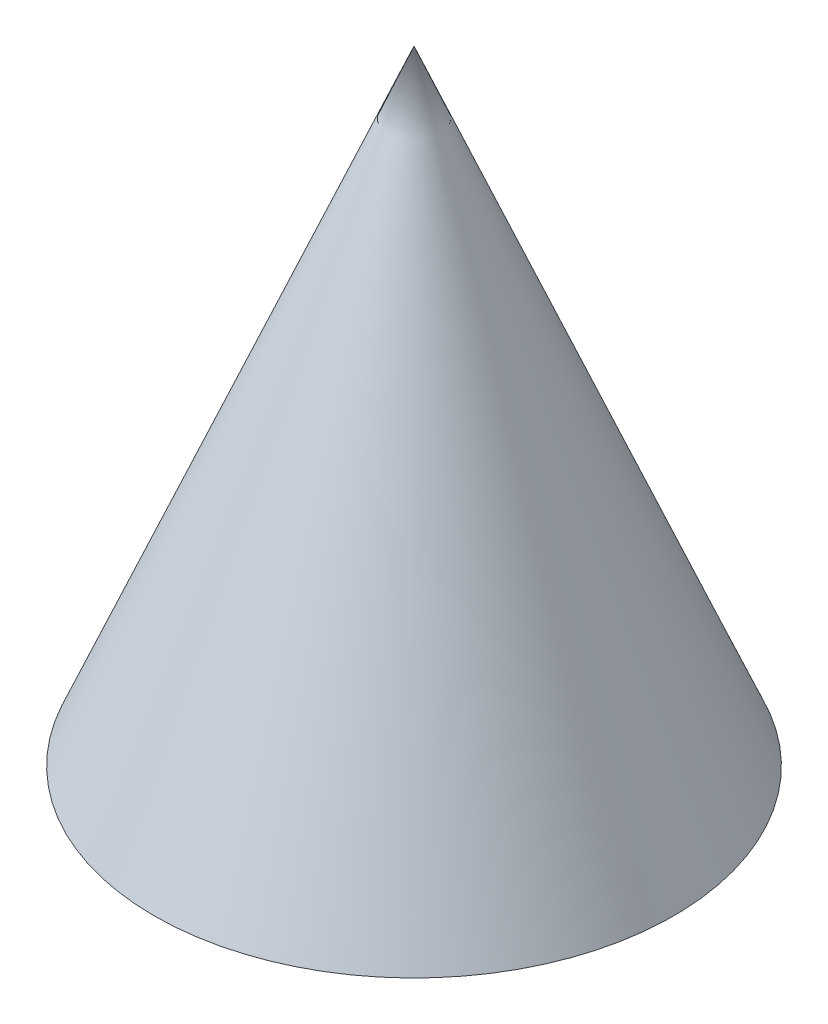
ISO-10303-21;
HEADER;
FILE_DESCRIPTION(('STEP AP214'),'2;1');
FILE_NAME('part.step','',(''),(''),'','','');
FILE_SCHEMA(('AUTOMOTIVE_DESIGN { 1 0 10303 214 1 1 1 1 }'));
ENDSEC;
DATA;
#1=APPLICATION_CONTEXT('core data for automotive mechanical design processes');
#2=APPLICATION_PROTOCOL_DEFINITION('international standard','automotive_design',2000,#1);
#3=PRODUCT_CONTEXT('',#1,'mechanical');
#4=PRODUCT('Part','Part','',(#3));
#5=PRODUCT_RELATED_PRODUCT_CATEGORY('part','',(#4));
#6=PRODUCT_DEFINITION_FORMATION('','',#4);
#7=PRODUCT_DEFINITION_CONTEXT('part definition',#1,'design');
#8=PRODUCT_DEFINITION('design','',#6,#7);
#9=PRODUCT_DEFINITION_SHAPE('','',#8);
#10=(LENGTH_UNIT() NAMED_UNIT(*) SI_UNIT(.MILLI.,.METRE.));
#11=(NAMED_UNIT(*) PLANE_ANGLE_UNIT() SI_UNIT($,.RADIAN.));
#12=(NAMED_UNIT(*) SI_UNIT($,.STERADIAN.) SOLID_ANGLE_UNIT());
#13=UNCERTAINTY_MEASURE_WITH_UNIT(LENGTH_MEASURE(1.E-05),#10,'distance_accuracy_value','');
#14=(GEOMETRIC_REPRESENTATION_CONTEXT(3) GLOBAL_UNCERTAINTY_ASSIGNED_CONTEXT((#13)) GLOBAL_UNIT_ASSIGNED_CONTEXT((#10,
#11,#12)) REPRESENTATION_CONTEXT('',''));
#15=CARTESIAN_POINT('',(0.,0.,0.));
#16=DIRECTION('',(0.,0.,1.));
#17=DIRECTION('',(1.,0.,0.));
#18=AXIS2_PLACEMENT_3D('',#15,#16,#17);
#19=CARTESIAN_POINT('',(-125.,0.,-125.000000000001));
#20=DIRECTION('',(0.,1.,0.));
#21=DIRECTION('',(0.,0.,1.));
#22=AXIS2_PLACEMENT_3D('',#19,#20,#21);
#23=PLANE('',#22);
#24=CARTESIAN_POINT('',(-6.46032281654135E-13,0.,1.38777878078145E-13));
#25=DIRECTION('',(0.,1.,0.));
#26=DIRECTION('',(0.,0.,1.));
#27=AXIS2_PLACEMENT_3D('',#24,#25,#26);
#28=CIRCLE('',#27,125.);
#29=CARTESIAN_POINT('',(-6.46032281654135E-13,0.,125.000000000001));
#30=VERTEX_POINT('',#29);
#31=EDGE_CURVE('E14',#30,#30,#28,.F.);
#32=ORIENTED_EDGE('',*,*,#31,.T.);
#33=EDGE_LOOP('',(#32));
#34=FACE_BOUND('',#33,.T.);
#35=ADVANCED_FACE('F78',(#34),#23,.F.);
#36=CARTESIAN_POINT('',(-6.46032281654135E-13,257.84023668639,1.38777878078145E-13));
#37=DIRECTION('',(0.,-1.,0.));
#38=DIRECTION('',(0.,0.,-1.));
#39=AXIS2_PLACEMENT_3D('',#36,#37,#38);
#40=CONICAL_SURFACE('',#39,17.5665680473378,0.394791119699766);
#41=CARTESIAN_POINT('',(-6.46032281654135E-13,300.,1.38777878078145E-13));
#42=VERTEX_POINT('',#41);
#43=VERTEX_LOOP('',#42);
#44=FACE_BOUND('',#43,.T.);
#45=ORIENTED_EDGE('',*,*,#31,.F.);
#46=EDGE_LOOP('',(#45));
#47=FACE_BOUND('',#46,.T.);
#48=ADVANCED_FACE('F80',(#44,#47),#40,.T.);
#49=CLOSED_SHELL('',(#35,#48));
#50=MANIFOLD_SOLID_BREP('B2',#49);
#51=ADVANCED_BREP_SHAPE_REPRESENTATION('',(#18,#50),#14);
#52=SHAPE_DEFINITION_REPRESENTATION(#9,#51);
ENDSEC;
END-ISO-10303-21;
